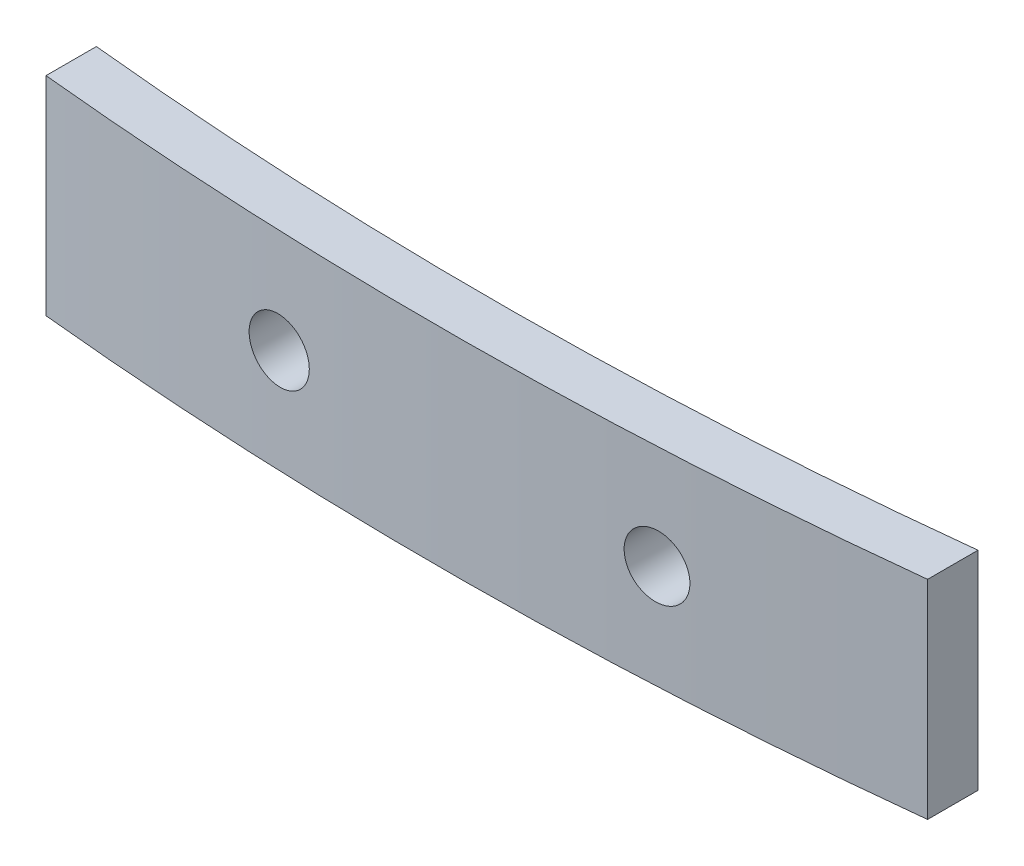
ISO-10303-21;
HEADER;
FILE_DESCRIPTION(('STEP AP214'),'2;1');
FILE_NAME('part.step','',(''),(''),'','','');
FILE_SCHEMA(('AUTOMOTIVE_DESIGN { 1 0 10303 214 1 1 1 1 }'));
ENDSEC;
DATA;
#1=APPLICATION_CONTEXT('core data for automotive mechanical design processes');
#2=APPLICATION_PROTOCOL_DEFINITION('international standard','automotive_design',2000,#1);
#3=PRODUCT_CONTEXT('',#1,'mechanical');
#4=PRODUCT('Part','Part','',(#3));
#5=PRODUCT_RELATED_PRODUCT_CATEGORY('part','',(#4));
#6=PRODUCT_DEFINITION_FORMATION('','',#4);
#7=PRODUCT_DEFINITION_CONTEXT('part definition',#1,'design');
#8=PRODUCT_DEFINITION('design','',#6,#7);
#9=PRODUCT_DEFINITION_SHAPE('','',#8);
#10=(LENGTH_UNIT() NAMED_UNIT(*) SI_UNIT(.MILLI.,.METRE.));
#11=(NAMED_UNIT(*) PLANE_ANGLE_UNIT() SI_UNIT($,.RADIAN.));
#12=(NAMED_UNIT(*) SI_UNIT($,.STERADIAN.) SOLID_ANGLE_UNIT());
#13=UNCERTAINTY_MEASURE_WITH_UNIT(LENGTH_MEASURE(1.E-05),#10,'distance_accuracy_value','');
#14=(GEOMETRIC_REPRESENTATION_CONTEXT(3) GLOBAL_UNCERTAINTY_ASSIGNED_CONTEXT((#13)) GLOBAL_UNIT_ASSIGNED_CONTEXT((#10,
#11,#12)) REPRESENTATION_CONTEXT('',''));
#15=CARTESIAN_POINT('',(0.,0.,0.));
#16=DIRECTION('',(0.,0.,1.));
#17=DIRECTION('',(1.,0.,0.));
#18=AXIS2_PLACEMENT_3D('',#15,#16,#17);
#19=CARTESIAN_POINT('',(-0.864955357142889,8.3,-164.510629845203));
#20=DIRECTION('',(0.,-1.,0.));
#21=DIRECTION('',(0.,0.,-1.));
#22=AXIS2_PLACEMENT_3D('',#19,#20,#21);
#23=CYLINDRICAL_SURFACE('',#22,165.210703971618);
#24=CARTESIAN_POINT('',(8.75,4.15,0.420050564105906));
#25=CARTESIAN_POINT('',(8.7499968756701,4.22012785151778,0.420050786641416));
#26=CARTESIAN_POINT('',(8.74407852912759,4.29030657591266,0.420396098331581));
#27=CARTESIAN_POINT('',(8.72055304510893,4.42872948848566,0.421764998652098));
#28=CARTESIAN_POINT('',(8.70293184075388,4.49697124536185,0.422789403552305));
#29=CARTESIAN_POINT('',(8.65650809093418,4.62949303841441,0.425475899042392));
#30=CARTESIAN_POINT('',(8.62771132313101,4.69377510184941,0.427137660119919));
#31=CARTESIAN_POINT('',(8.55976687690109,4.81657159404113,0.431033993499507));
#32=CARTESIAN_POINT('',(8.52062172919151,4.87508742814449,0.433268425749608));
#33=CARTESIAN_POINT('',(8.43305223614725,4.98477091182553,0.438227928441564));
#34=CARTESIAN_POINT('',(8.38461943762333,5.0359317924697,0.440953445708678));
#35=CARTESIAN_POINT('',(8.27987264209871,5.12940091687988,0.446793671892669));
#36=CARTESIAN_POINT('',(8.22355827497798,5.17170874467183,0.449908399086186));
#37=CARTESIAN_POINT('',(8.10455421106636,5.24633687235545,0.456421883334665));
#38=CARTESIAN_POINT('',(8.04185485362085,5.27864172993917,0.459821069355648));
#39=CARTESIAN_POINT('',(7.91193085692122,5.3322656283006,0.466784376452273));
#40=CARTESIAN_POINT('',(7.84470619336023,5.35358461006432,0.470348498413806));
#41=CARTESIAN_POINT('',(7.70755407236171,5.38465422269091,0.47753187341042));
#42=CARTESIAN_POINT('',(7.63762353654749,5.39439125228122,0.481151186219383));
#43=CARTESIAN_POINT('',(7.49711770071093,5.40197506678777,0.488331935567919));
#44=CARTESIAN_POINT('',(7.42654240018963,5.39982184250167,0.491893372062698));
#45=CARTESIAN_POINT('',(7.28673057784616,5.38368125095752,0.498859654116249));
#46=CARTESIAN_POINT('',(7.2174944251081,5.36969066742186,0.50226445685162));
#47=CARTESIAN_POINT('',(7.0823491009662,5.33026368881494,0.508828518634869));
#48=CARTESIAN_POINT('',(7.01643992557216,5.30482730747152,0.511987777977241));
#49=CARTESIAN_POINT('',(6.8898629668437,5.24324445263167,0.517984389992272));
#50=CARTESIAN_POINT('',(6.82919212444487,5.20710428528416,0.520821930848433));
#51=CARTESIAN_POINT('',(6.71477797427487,5.12513018115386,0.526116471355506));
#52=CARTESIAN_POINT('',(6.66103462822729,5.07929629793533,0.52857347310902));
#53=CARTESIAN_POINT('',(6.56206132205862,4.97928608662616,0.533057060848424));
#54=CARTESIAN_POINT('',(6.51682265931467,4.92511839069348,0.535084087092821));
#55=CARTESIAN_POINT('',(6.43608202244562,4.80994284773568,0.538675511251535));
#56=CARTESIAN_POINT('',(6.40057999610528,4.74893503739491,0.540239911646806));
#57=CARTESIAN_POINT('',(6.340357933409,4.62187706871117,0.542879900415455));
#58=CARTESIAN_POINT('',(6.31562712260273,4.55583202720676,0.543955977304391));
#59=CARTESIAN_POINT('',(6.27760214546197,4.42052190669178,0.545605857793076));
#60=CARTESIAN_POINT('',(6.26430793152615,4.35125684108483,0.546179663483375));
#61=CARTESIAN_POINT('',(6.24954097440456,4.21152203853996,0.546816834887879));
#62=CARTESIAN_POINT('',(6.24806041369155,4.14105312917926,0.546880538155648));
#63=CARTESIAN_POINT('',(6.25694243045685,4.00086716847885,0.546497531082771));
#64=CARTESIAN_POINT('',(6.26730498629387,3.93115011576549,0.546050821674816));
#65=CARTESIAN_POINT('',(6.29957441132196,3.79445965589939,0.544653251256617));
#66=CARTESIAN_POINT('',(6.3214792062226,3.72748575809605,0.543702480832502));
#67=CARTESIAN_POINT('',(6.37620694922726,3.59816781419316,0.541310528570389));
#68=CARTESIAN_POINT('',(6.40902990399195,3.5358237709181,0.539869346433213));
#69=CARTESIAN_POINT('',(6.48467114761501,3.4175119277289,0.536518343609078));
#70=CARTESIAN_POINT('',(6.52749274492063,3.36154624749035,0.534608367792417));
#71=CARTESIAN_POINT('',(6.62190587875572,3.25759845060247,0.530352467316842));
#72=CARTESIAN_POINT('',(6.6734974488955,3.2096163645511,0.528006540987174));
#73=CARTESIAN_POINT('',(6.78402732919472,3.1229563323932,0.522920767674274));
#74=CARTESIAN_POINT('',(6.8429713797798,3.08428572609344,0.520180612638965));
#75=CARTESIAN_POINT('',(6.96649912462997,3.01738774672038,0.51436476411554));
#76=CARTESIAN_POINT('',(7.03108284432829,2.98916042074618,0.511289069114225));
#77=CARTESIAN_POINT('',(7.16412839034453,2.94391857326429,0.504869298035268));
#78=CARTESIAN_POINT('',(7.23259422327701,2.92691587381022,0.501524943142095));
#79=CARTESIAN_POINT('',(7.37140001377697,2.90464748821122,0.494654869625039));
#80=CARTESIAN_POINT('',(7.44173998602875,2.89938189405638,0.491129149579919));
#81=CARTESIAN_POINT('',(7.58236818374903,2.90073434853974,0.483989440786617));
#82=CARTESIAN_POINT('',(7.65265629683359,2.90736367487349,0.480375371478415));
#83=CARTESIAN_POINT('',(7.79112055707237,2.9323391674771,0.473168949725147));
#84=CARTESIAN_POINT('',(7.85929669259729,2.95068539825232,0.469576597399751));
#85=CARTESIAN_POINT('',(7.99162839490877,2.99858567305698,0.462525628244137));
#86=CARTESIAN_POINT('',(8.05578240324823,3.02814403053687,0.459067063448728));
#87=CARTESIAN_POINT('',(8.17821506459887,3.09763191261792,0.452400980172807));
#88=CARTESIAN_POINT('',(8.23649395687128,3.13756101463856,0.449193451470163));
#89=CARTESIAN_POINT('',(8.34548259383017,3.22663160990741,0.44314404983962));
#90=CARTESIAN_POINT('',(8.39619733991694,3.27576696706239,0.440301935473492));
#91=CARTESIAN_POINT('',(8.4886680570718,3.38189249727254,0.435084215694027));
#92=CARTESIAN_POINT('',(8.5304218580004,3.43888456757103,0.432708723297817));
#93=CARTESIAN_POINT('',(8.60372478212185,3.55903320833602,0.428516976642923));
#94=CARTESIAN_POINT('',(8.6352829269122,3.62218426425832,0.426700228050152));
#95=CARTESIAN_POINT('',(8.68731128395109,3.75285295151056,0.423695249568868));
#96=CARTESIAN_POINT('',(8.70779492398493,3.82036518318595,0.422506258568424));
#97=CARTESIAN_POINT('',(8.73161237551989,3.93192617529781,0.421121713201919));
#98=CARTESIAN_POINT('',(8.73849904429465,3.97524605096882,0.420720697745676));
#99=CARTESIAN_POINT('',(8.74769383053028,4.06237066227353,0.420185053794028));
#100=CARTESIAN_POINT('',(8.75000195246986,4.1061753974329,0.420050425038045));
#101=CARTESIAN_POINT('',(8.75,4.15,0.420050564105906));
#102=B_SPLINE_CURVE_WITH_KNOTS('',3,(#24,#25,#26,#27,#28,#29,#30,#31,#32,#33,#34,#35,#36,#37,
#38,#39,#40,#41,#42,#43,#44,#45,#46,#47,#48,#49,#50,#51,#52,#53,#54,#55,#56,#57,#58,#59,#60,#61,
#62,#63,#64,#65,#66,#67,#68,#69,#70,#71,#72,#73,#74,#75,#76,#77,#78,#79,#80,#81,#82,#83,#84,#85,
#86,#87,#88,#89,#90,#91,#92,#93,#94,#95,#96,#97,#98,#99,#100,#101),.UNSPECIFIED.,.T.,.F.,(4,2,2,
2,2,2,2,2,2,2,2,2,2,2,2,2,2,2,2,2,2,2,2,2,2,2,2,2,2,2,2,2,2,2,2,2,2,2,4),(0.,0.210223445977021,
0.420700039769353,0.631067963784939,0.841384489415681,1.0518933518043,1.26241210304977,
1.47325424539596,1.68409752033319,1.89518815550945,2.10627895405728,2.31742712559702,
2.52857504389096,2.73959881074264,2.95062141157759,3.16142688888051,3.37223123566221,
3.58282422776111,3.79341634332708,4.00386909080652,4.21432145372016,4.42473600850072,
4.63515069164558,4.84563509774261,5.05612031052455,5.26677089982141,5.47742243913898,
5.68829548939093,5.89917019236428,6.11024493345311,6.32132083658665,6.53247802584897,
6.74362661236154,6.95463496292118,7.16569435743921,7.37656648187793,7.58718234815398,
7.71855622861525,7.84992998056732),.UNSPECIFIED.);
#103=CARTESIAN_POINT('',(8.75,4.15,0.420050564105906));
#104=VERTEX_POINT('',#103);
#105=EDGE_CURVE('E122',#104,#104,#102,.T.);
#106=ORIENTED_EDGE('',*,*,#105,.T.);
#107=EDGE_LOOP('',(#106));
#108=FACE_BOUND('',#107,.T.);
#109=CARTESIAN_POINT('',(-6.25,4.15,0.612288009926604));
#110=CARTESIAN_POINT('',(-6.25000311571131,4.22018355239191,0.612287948701828));
#111=CARTESIAN_POINT('',(-6.25593075978931,4.2904179787371,0.612094924403045));
#112=CARTESIAN_POINT('',(-6.27949447756528,4.42895209563306,0.611323893589454));
#113=CARTESIAN_POINT('',(-6.2971446367521,4.49724935546489,0.610745423930159));
#114=CARTESIAN_POINT('',(-6.34364908837448,4.62988168369549,0.609208938538244));
#115=CARTESIAN_POINT('',(-6.37249792853421,4.69421866259394,0.60825110749982));
#116=CARTESIAN_POINT('',(-6.44057119968027,4.81711670051832,0.605966440329405));
#117=CARTESIAN_POINT('',(-6.47979305791574,4.87567918681573,0.60463969569242));
#118=CARTESIAN_POINT('',(-6.56751337852462,4.9854062839793,0.601633356485878));
#119=CARTESIAN_POINT('',(-6.61601467183209,5.03656862885316,0.599953654221964));
#120=CARTESIAN_POINT('',(-6.72090916987377,5.13002658482638,0.596266618886532));
#121=CARTESIAN_POINT('',(-6.77730270118661,5.17232182882653,0.594259272256609));
#122=CARTESIAN_POINT('',(-6.89640796884524,5.24686589631549,0.589951115896844));
#123=CARTESIAN_POINT('',(-6.95912282670767,5.27910972386023,0.587650161030504));
#124=CARTESIAN_POINT('',(-7.08906630444559,5.3326117277739,0.582802406813894));
#125=CARTESIAN_POINT('',(-7.15629493167516,5.35386988624392,0.580255607063078));
#126=CARTESIAN_POINT('',(-7.29340442194187,5.38481197096959,0.574973575011229));
#127=CARTESIAN_POINT('',(-7.36328700154222,5.39448826991545,0.572238219788182));
#128=CARTESIAN_POINT('',(-7.50368007668842,5.4019696691906,0.56665198267269));
#129=CARTESIAN_POINT('',(-7.57419057342636,5.39977474697769,0.563801100560882));
#130=CARTESIAN_POINT('',(-7.71387945362295,5.38357292521863,0.558064449045412));
#131=CARTESIAN_POINT('',(-7.78305707886924,5.36955949439595,0.555178661221106));
#132=CARTESIAN_POINT('',(-7.91807733611011,5.33010934361725,0.549464502868027));
#133=CARTESIAN_POINT('',(-7.98391995872912,5.30467259154922,0.546636132500682));
#134=CARTESIAN_POINT('',(-8.11040870949573,5.24309180134629,0.54113211185841));
#135=CARTESIAN_POINT('',(-8.17105421102282,5.20694647440621,0.538456480012221));
#136=CARTESIAN_POINT('',(-8.28541568787778,5.12497267595302,0.533354465386389));
#137=CARTESIAN_POINT('',(-8.33913167949136,5.07914422719782,0.530928082020964));
#138=CARTESIAN_POINT('',(-8.43807894852099,4.97912832988149,0.526417399872258));
#139=CARTESIAN_POINT('',(-8.48331455816759,4.92494517527411,0.524332926491592));
#140=CARTESIAN_POINT('',(-8.56404495416109,4.80973912005988,0.520586488920757));
#141=CARTESIAN_POINT('',(-8.59953979122227,4.74871625506557,0.518924522530854));
#142=CARTESIAN_POINT('',(-8.65974439972634,4.6216271240783,0.516091877374447));
#143=CARTESIAN_POINT('',(-8.68446475412751,4.55556588220122,0.514920716570525));
#144=CARTESIAN_POINT('',(-8.72246441910089,4.42022399273247,0.513115788962741));
#145=CARTESIAN_POINT('',(-8.73574379707123,4.35094336410855,0.512482018993142));
#146=CARTESIAN_POINT('',(-8.75047458862379,4.2111980915843,0.511778780959092));
#147=CARTESIAN_POINT('',(-8.75193694008761,4.14073460310762,0.511708791058003));
#148=CARTESIAN_POINT('',(-8.74302066539331,4.0005626973153,0.512134684324352));
#149=CARTESIAN_POINT('',(-8.73264207065434,3.93085427799663,0.512630565990288));
#150=CARTESIAN_POINT('',(-8.70034544962065,3.79419204857333,0.514167162544728));
#151=CARTESIAN_POINT('',(-8.67843080347073,3.7272374377756,0.515207717839497));
#152=CARTESIAN_POINT('',(-8.62368951853576,3.59795898046812,0.517790426931301));
#153=CARTESIAN_POINT('',(-8.5908628581906,3.5356351431082,0.519332581719403));
#154=CARTESIAN_POINT('',(-8.51521227384373,3.41735055124752,0.522856772119375));
#155=CARTESIAN_POINT('',(-8.47238306461757,3.36139318403883,0.524839040254345));
#156=CARTESIAN_POINT('',(-8.3779548356778,3.25746147580423,0.52916466983499));
#157=CARTESIAN_POINT('',(-8.32635576524137,3.20948718095373,0.53150803336915));
#158=CARTESIAN_POINT('',(-8.21579579794787,3.12283180802716,0.536469223168007));
#159=CARTESIAN_POINT('',(-8.15682751540769,3.08416016875794,0.539087324356433));
#160=CARTESIAN_POINT('',(-8.03324331961947,3.01726497292627,0.544500869169606));
#161=CARTESIAN_POINT('',(-7.96862738257522,2.98904146038931,0.547296313541571));
#162=CARTESIAN_POINT('',(-7.8355196571947,2.94381943465548,0.552971163005119));
#163=CARTESIAN_POINT('',(-7.76702449530367,2.92683085980956,0.555850640087178));
#164=CARTESIAN_POINT('',(-7.62815314481567,2.90459979079998,0.561598861621527));
#165=CARTESIAN_POINT('',(-7.55777694822369,2.89935734656927,0.564467606028139));
#166=CARTESIAN_POINT('',(-7.41711753048462,2.90076871395252,0.570110501825143));
#167=CARTESIAN_POINT('',(-7.34683434598474,2.90742630602083,0.572884622869854));
#168=CARTESIAN_POINT('',(-7.20837958754747,2.93245878709451,0.578262808404097));
#169=CARTESIAN_POINT('',(-7.14020801585102,2.95083368853438,0.580866872713159));
#170=CARTESIAN_POINT('',(-7.00793228027882,2.99877590873363,0.58584172349279));
#171=CARTESIAN_POINT('',(-6.94382705094201,3.02834028137105,0.588212571161087));
#172=CARTESIAN_POINT('',(-6.82149085700398,3.09782436801472,0.592671585008922));
#173=CARTESIAN_POINT('',(-6.76325964443876,3.13774364464784,0.59475976312226));
#174=CARTESIAN_POINT('',(-6.65436671082572,3.22677356012875,0.598613974910899));
#175=CARTESIAN_POINT('',(-6.60369956033725,3.27587754864781,0.600380239856701));
#176=CARTESIAN_POINT('',(-6.51131557625305,3.38191903380727,0.603565383454531));
#177=CARTESIAN_POINT('',(-6.46960094041181,3.43885844835036,0.604984176817734));
#178=CARTESIAN_POINT('',(-6.39633408535729,3.55892548464134,0.607454882195929));
#179=CARTESIAN_POINT('',(-6.36478028832285,3.62205214361811,0.60850685117518));
#180=CARTESIAN_POINT('',(-6.31275419768299,3.75266197816612,0.610231582461445));
#181=CARTESIAN_POINT('',(-6.29226858560104,3.82013980793337,0.610904800564298));
#182=CARTESIAN_POINT('',(-6.26842481149668,3.93170707646447,0.611686340087224));
#183=CARTESIAN_POINT('',(-6.26152415895528,3.9750705609376,0.61191184300066));
#184=CARTESIAN_POINT('',(-6.25231078003501,4.06228273831287,0.612212697036008));
#185=CARTESIAN_POINT('',(-6.24999805250957,4.10613143109375,0.612288048195446));
#186=CARTESIAN_POINT('',(-6.25,4.15,0.612288009926604));
#187=B_SPLINE_CURVE_WITH_KNOTS('',3,(#109,#110,#111,#112,#113,#114,#115,#116,#117,#118,#119,
#120,#121,#122,#123,#124,#125,#126,#127,#128,#129,#130,#131,#132,#133,#134,#135,#136,#137,#138,
#139,#140,#141,#142,#143,#144,#145,#146,#147,#148,#149,#150,#151,#152,#153,#154,#155,#156,#157,
#158,#159,#160,#161,#162,#163,#164,#165,#166,#167,#168,#169,#170,#171,#172,#173,#174,#175,#176,
#177,#178,#179,#180,#181,#182,#183,#184,#185,#186),.UNSPECIFIED.,.T.,.F.,(4,2,2,2,2,2,2,2,2,2,2,
2,2,2,2,2,2,2,2,2,2,2,2,2,2,2,2,2,2,2,2,2,2,2,2,2,2,2,4),(0.,0.210390503068588,
0.421034264711717,0.631575599082519,0.842064763174761,1.05261824517612,1.26318044240039,
1.47384713095046,1.68451416273795,1.89531985448584,2.10612594653145,2.3170486129942,
2.52797187238342,2.7389205272615,2.94986868635966,3.16070878649296,3.3715477888891,
3.58217923083019,3.79280943194546,4.00324465064315,4.21367931096638,4.42405234673518,
4.63442579816419,4.84491066085422,5.05539674098095,5.26609549541984,5.47679513767428,
5.6876809150019,5.89856758880574,6.10952126989617,6.32047517485255,6.53137357548215,
6.74226306958042,6.95300045295797,7.1637895112675,7.37454582149352,7.58504795814686,
7.71655359263121,7.8480591942506),.UNSPECIFIED.);
#188=CARTESIAN_POINT('',(-6.25,4.15,0.612288009926604));
#189=VERTEX_POINT('',#188);
#190=EDGE_CURVE('E139',#189,#189,#187,.T.);
#191=ORIENTED_EDGE('',*,*,#190,.T.);
#192=EDGE_LOOP('',(#191));
#193=FACE_BOUND('',#192,.T.);
#194=CARTESIAN_POINT('',(-0.864955357142889,0.,-164.510629845203));
#195=DIRECTION('',(0.,-1.,0.));
#196=DIRECTION('',(0.,0.,1.));
#197=AXIS2_PLACEMENT_3D('',#194,#195,#196);
#198=CIRCLE('',#197,165.210703971618);
#199=CARTESIAN_POINT('',(17.5,0.,-0.323830371166123));
#200=VERTEX_POINT('',#199);
#201=CARTESIAN_POINT('',(-17.5,0.,-0.139549674366385));
#202=VERTEX_POINT('',#201);
#203=EDGE_CURVE('E118',#200,#202,#198,.T.);
#204=ORIENTED_EDGE('',*,*,#203,.T.);
#205=DIRECTION('',(0.,-1.,0.));
#206=VECTOR('',#205,1.);
#207=CARTESIAN_POINT('',(-17.5,8.3,-0.139549674366385));
#208=LINE('',#207,#206);
#209=CARTESIAN_POINT('',(-17.5,8.3,-0.139549674366385));
#210=VERTEX_POINT('',#209);
#211=EDGE_CURVE('E11',#210,#202,#208,.T.);
#212=ORIENTED_EDGE('',*,*,#211,.F.);
#213=CARTESIAN_POINT('',(-0.864955357142889,8.3,-164.510629845203));
#214=DIRECTION('',(0.,-1.,0.));
#215=DIRECTION('',(0.,0.,1.));
#216=AXIS2_PLACEMENT_3D('',#213,#214,#215);
#217=CIRCLE('',#216,165.210703971618);
#218=CARTESIAN_POINT('',(17.5,8.3,-0.323830371166123));
#219=VERTEX_POINT('',#218);
#220=EDGE_CURVE('E101',#219,#210,#217,.T.);
#221=ORIENTED_EDGE('',*,*,#220,.F.);
#222=DIRECTION('',(0.,-1.,0.));
#223=VECTOR('',#222,1.);
#224=CARTESIAN_POINT('',(17.5,8.3,-0.323830371166123));
#225=LINE('',#224,#223);
#226=EDGE_CURVE('E114',#219,#200,#225,.T.);
#227=ORIENTED_EDGE('',*,*,#226,.T.);
#228=EDGE_LOOP('',(#204,#212,#221,#227));
#229=FACE_BOUND('',#228,.T.);
#230=ADVANCED_FACE('F41',(#108,#193,#229),#23,.F.);
#231=CARTESIAN_POINT('',(-17.5,8.3,-0.139549674366385));
#232=DIRECTION('',(1.,0.,0.));
#233=DIRECTION('',(0.,0.,-1.));
#234=AXIS2_PLACEMENT_3D('',#231,#232,#233);
#235=PLANE('',#234);
#236=DIRECTION('',(0.,0.,1.));
#237=VECTOR('',#236,1.);
#238=CARTESIAN_POINT('',(-17.5,0.,-0.139549674366385));
#239=LINE('',#238,#237);
#240=CARTESIAN_POINT('',(-17.5,0.,1.87054340590159));
#241=VERTEX_POINT('',#240);
#242=EDGE_CURVE('E106',#202,#241,#239,.T.);
#243=ORIENTED_EDGE('',*,*,#242,.T.);
#244=DIRECTION('',(0.,-1.,0.));
#245=VECTOR('',#244,1.);
#246=CARTESIAN_POINT('',(-17.5,8.3,1.87054340590159));
#247=LINE('',#246,#245);
#248=CARTESIAN_POINT('',(-17.5,8.3,1.87054340590159));
#249=VERTEX_POINT('',#248);
#250=EDGE_CURVE('E57',#249,#241,#247,.T.);
#251=ORIENTED_EDGE('',*,*,#250,.F.);
#252=DIRECTION('',(0.,0.,1.));
#253=VECTOR('',#252,1.);
#254=CARTESIAN_POINT('',(-17.5,8.3,-0.139549674366385));
#255=LINE('',#254,#253);
#256=EDGE_CURVE('E96',#210,#249,#255,.T.);
#257=ORIENTED_EDGE('',*,*,#256,.F.);
#258=ORIENTED_EDGE('',*,*,#211,.T.);
#259=EDGE_LOOP('',(#243,#251,#257,#258));
#260=FACE_BOUND('',#259,.T.);
#261=ADVANCED_FACE('F105',(#260),#235,.F.);
#262=CARTESIAN_POINT('',(-0.864955357142889,8.3,-164.510629845203));
#263=DIRECTION('',(0.,-1.,0.));
#264=DIRECTION('',(0.,0.,-1.));
#265=AXIS2_PLACEMENT_3D('',#262,#263,#264);
#266=CYLINDRICAL_SURFACE('',#265,167.210703971618);
#267=CARTESIAN_POINT('',(8.75,4.15,2.42340549859404));
#268=CARTESIAN_POINT('',(8.7499968759262,4.07987012137044,2.42340571844586));
#269=CARTESIAN_POINT('',(8.74407819084325,4.00968936898739,2.42374690560115));
#270=CARTESIAN_POINT('',(8.72055131717487,3.87126241398294,2.42509945786627));
#271=CARTESIAN_POINT('',(8.70292906080826,3.80301864269076,2.42611162950184));
#272=CARTESIAN_POINT('',(8.65650238633006,3.67049285173357,2.4287660522962));
#273=CARTESIAN_POINT('',(8.62770373590653,3.60620880840686,2.43040797845888));
#274=CARTESIAN_POINT('',(8.55975462355993,3.48340863823658,2.43425781776976));
#275=CARTESIAN_POINT('',(8.52060669359667,3.42489110541184,2.43646559247862));
#276=CARTESIAN_POINT('',(8.43303156162517,3.31520582991078,2.44136589382248));
#277=CARTESIAN_POINT('',(8.38459608361104,3.26404471412625,2.44405885266811));
#278=CARTESIAN_POINT('',(8.27984339346623,3.17057563894572,2.44982931904001));
#279=CARTESIAN_POINT('',(8.22352581262794,3.12826809393164,2.45290684455476));
#280=CARTESIAN_POINT('',(8.10451714174231,3.05364269118637,2.45934241559074));
#281=CARTESIAN_POINT('',(8.041816623435,3.02133990455394,2.46270087473628));
#282=CARTESIAN_POINT('',(7.91189047346441,2.96772029239522,2.46958074239435));
#283=CARTESIAN_POINT('',(7.84466481828969,2.9464035239544,2.4731021517535));
#284=CARTESIAN_POINT('',(7.70751294966958,2.91533895910661,2.48019932744157));
#285=CARTESIAN_POINT('',(7.63758373153518,2.90560444024127,2.48377515140502));
#286=CARTESIAN_POINT('',(7.49708099898386,2.89802511241837,2.49086960284267));
#287=CARTESIAN_POINT('',(7.42650748410816,2.90018031192793,2.49438823027613));
#288=CARTESIAN_POINT('',(7.28670012554887,2.91632414244071,2.50127073842057));
#289=CARTESIAN_POINT('',(7.21746664220022,2.93031591229712,2.50463457783493));
#290=CARTESIAN_POINT('',(7.08232692497333,2.96974430691074,2.51111965594278));
#291=CARTESIAN_POINT('',(7.01642068728273,2.99518091855414,2.51424089491422));
#292=CARTESIAN_POINT('',(6.88984875734409,3.05676359416933,2.520165375863));
#293=CARTESIAN_POINT('',(6.82918007858731,3.09290350222251,2.52296879935137));
#294=CARTESIAN_POINT('',(6.71477020629758,3.17487622745391,2.52819967652553));
#295=CARTESIAN_POINT('',(6.66102897533549,3.22070899225789,2.53062713224269));
#296=CARTESIAN_POINT('',(6.56205835230829,3.32071733576925,2.53505686160251));
#297=CARTESIAN_POINT('',(6.51682046506705,3.37488448861664,2.5370595598542));
#298=CARTESIAN_POINT('',(6.43608126204884,3.49005848772344,2.54060787994089));
#299=CARTESIAN_POINT('',(6.40057989533456,3.55106529819833,2.54215350416711));
#300=CARTESIAN_POINT('',(6.34035812216982,3.67812241017294,2.54476184415459));
#301=CARTESIAN_POINT('',(6.31562719806153,3.7441677170099,2.545825031073));
#302=CARTESIAN_POINT('',(6.2776020971927,3.87947825233901,2.54745514622849));
#303=CARTESIAN_POINT('',(6.26430787395331,3.94874346774423,2.54802207648237));
#304=CARTESIAN_POINT('',(6.24954082405741,4.08847961995922,2.54865161672816));
#305=CARTESIAN_POINT('',(6.24806036595877,4.15894974892714,2.54871455229005));
#306=CARTESIAN_POINT('',(6.25694299560165,4.29913811959953,2.54833610858745));
#307=CARTESIAN_POINT('',(6.2673060622287,4.36885636264422,2.54789473022203));
#308=CARTESIAN_POINT('',(6.29957701281969,4.50554944308895,2.54651384125092));
#309=CARTESIAN_POINT('',(6.321482871838,4.57252475945876,2.54557441801678));
#310=CARTESIAN_POINT('',(6.3762133200028,4.70184538321581,2.54321101100255));
#311=CARTESIAN_POINT('',(6.40903791561766,4.76419068786017,2.54178702693539));
#312=CARTESIAN_POINT('',(6.48468275935071,4.88250430561796,2.53847602046889));
#313=CARTESIAN_POINT('',(6.52750623741589,4.9384705493861,2.53658884843546));
#314=CARTESIAN_POINT('',(6.6219236312372,5.04241915222049,2.5323837556043));
#315=CARTESIAN_POINT('',(6.67351757989245,5.09040148133676,2.53006583319077));
#316=CARTESIAN_POINT('',(6.78405166747195,5.17706068505861,2.5250408107236));
#317=CARTESIAN_POINT('',(6.84299741070677,5.21573039397913,2.52233341352717));
#318=CARTESIAN_POINT('',(6.96652874466183,5.28262627072503,2.51658709195815));
#319=CARTESIAN_POINT('',(7.03111436007255,5.31085239282717,2.51354816613418));
#320=CARTESIAN_POINT('',(7.16416214246729,5.35609080416202,2.5072052239132));
#321=CARTESIAN_POINT('',(7.23262822078288,5.37309155233608,2.50390093859557));
#322=CARTESIAN_POINT('',(7.37143437970746,5.39535605206446,2.49711318891029));
#323=CARTESIAN_POINT('',(7.44177447473131,5.40061971331127,2.4936297231642));
#324=CARTESIAN_POINT('',(7.58240109739181,5.39926339313341,2.4865756781979));
#325=CARTESIAN_POINT('',(7.65268751511746,5.39263240341705,2.48300502130082));
#326=CARTESIAN_POINT('',(7.79114816585301,5.36765414255638,2.4758851856896));
#327=CARTESIAN_POINT('',(7.8593223874094,5.34930680789114,2.47233600709201));
#328=CARTESIAN_POINT('',(7.99164948058038,5.30140518650286,2.46536983325012));
#329=CARTESIAN_POINT('',(8.05580082929915,5.27184668517906,2.46195288824925));
#330=CARTESIAN_POINT('',(8.17822818102457,5.20235946919012,2.45536704386846));
#331=CARTESIAN_POINT('',(8.23650442308893,5.16243117670771,2.45219813439716));
#332=CARTESIAN_POINT('',(8.34548871241756,5.07336264520676,2.44622154154587));
#333=CARTESIAN_POINT('',(8.39620166121003,5.02422841925977,2.44341362438257));
#334=CARTESIAN_POINT('',(8.48866906289056,4.91810600261773,2.43825869201559));
#335=CARTESIAN_POINT('',(8.53042134428022,4.86111591364173,2.43591178854408));
#336=CARTESIAN_POINT('',(8.60372300458297,4.74097006582692,2.43177041236711));
#337=CARTESIAN_POINT('',(8.63528107441361,4.67781961903462,2.42997546915954));
#338=CARTESIAN_POINT('',(8.68730942116913,4.5471524942547,2.42700655200384));
#339=CARTESIAN_POINT('',(8.70779312246654,4.47964121417121,2.42583182626751));
#340=CARTESIAN_POINT('',(8.73161132337617,4.36808002854529,2.42446385353792));
#341=CARTESIAN_POINT('',(8.7384983882257,4.32475891370707,2.42406762781939));
#342=CARTESIAN_POINT('',(8.74769370050571,4.23763182151305,2.42353838177779));
#343=CARTESIAN_POINT('',(8.75000195230871,4.1938258446203,2.42340536120337));
#344=CARTESIAN_POINT('',(8.75,4.15,2.42340549859404));
#345=B_SPLINE_CURVE_WITH_KNOTS('',3,(#267,#268,#269,#270,#271,#272,#273,#274,#275,#276,#277,
#278,#279,#280,#281,#282,#283,#284,#285,#286,#287,#288,#289,#290,#291,#292,#293,#294,#295,#296,
#297,#298,#299,#300,#301,#302,#303,#304,#305,#306,#307,#308,#309,#310,#311,#312,#313,#314,#315,
#316,#317,#318,#319,#320,#321,#322,#323,#324,#325,#326,#327,#328,#329,#330,#331,#332,#333,#334,
#335,#336,#337,#338,#339,#340,#341,#342,#343,#344),.UNSPECIFIED.,.T.,.F.,(4,2,2,2,2,2,2,2,2,2,2,
2,2,2,2,2,2,2,2,2,2,2,2,2,2,2,2,2,2,2,2,2,2,2,2,2,2,2,4),(0.,0.210229526330766,
0.420712208603477,0.631086413349325,0.841409197426138,1.05192027556956,1.26244120425612,
1.47327773487148,1.684115361023,1.89519445291078,2.10627369511606,2.31740892942866,
2.52854392181756,2.7395577165822,2.95057037118733,3.16137108216245,3.37217069029722,
3.58276398222082,3.79335641828739,4.00381280507794,4.21426881667042,4.42468792036777,
4.63510714871938,4.84559444323099,5.0560825273238,5.26673205968139,5.47738251427596,
5.68824920749127,5.89911752315157,6.11018109445236,6.32124581005774,6.53238994974381,
6.74352549451836,6.95452360890834,7.16557279828773,7.37644158314923,7.58705417601551,
7.71843177902917,7.84980925658394),.UNSPECIFIED.);
#346=CARTESIAN_POINT('',(8.75,4.15,2.42340549859404));
#347=VERTEX_POINT('',#346);
#348=EDGE_CURVE('E45',#347,#347,#345,.T.);
#349=ORIENTED_EDGE('',*,*,#348,.T.);
#350=EDGE_LOOP('',(#349));
#351=FACE_BOUND('',#350,.T.);
#352=CARTESIAN_POINT('',(-6.25,4.15,2.61333856411394));
#353=CARTESIAN_POINT('',(-6.25000311565992,4.07981574606103,2.61333850362469));
#354=CARTESIAN_POINT('',(-6.25593087719105,4.00958061729741,2.61314778671223));
#355=CARTESIAN_POINT('',(-6.27949507550797,3.87104510438208,2.61238597227617));
#356=CARTESIAN_POINT('',(-6.297145598251,3.80274715099205,2.61181441713833));
#357=CARTESIAN_POINT('',(-6.34365105592586,3.67011345543528,2.61029629603647));
#358=CARTESIAN_POINT('',(-6.37250054084197,3.60577580359118,2.60934991247952));
#359=CARTESIAN_POINT('',(-6.44057541610514,3.48287650486345,2.60709254775912));
#360=CARTESIAN_POINT('',(-6.4797982334516,3.42431343059236,2.60578165700387));
#361=CARTESIAN_POINT('',(-6.56752060650743,3.31458558372347,2.60281124515757));
#362=CARTESIAN_POINT('',(-6.61602294900017,3.26342304174475,2.60115161932128));
#363=CARTESIAN_POINT('',(-6.72091982579359,3.169964875977,2.5975086494016));
#364=CARTESIAN_POINT('',(-6.77731468628578,3.12766961884637,2.59552529193808));
#365=CARTESIAN_POINT('',(-6.89642214749191,3.05312628172291,2.59126864347545));
#366=CARTESIAN_POINT('',(-6.95913779281653,3.02088307452851,2.58899521261149));
#367=CARTESIAN_POINT('',(-7.08908295006164,2.96738245851538,2.58420544720455));
#368=CARTESIAN_POINT('',(-7.15631246894652,2.94612506664691,2.58168911228679));
#369=CARTESIAN_POINT('',(-7.2934227128282,2.91518499163511,2.5764703066392));
#370=CARTESIAN_POINT('',(-7.36330511368689,2.90550975498857,2.57376771734056));
#371=CARTESIAN_POINT('',(-7.50369776502639,2.89803039840271,2.56824840244642));
#372=CARTESIAN_POINT('',(-7.57420801664396,2.90022629996097,2.56543167664425));
#373=CARTESIAN_POINT('',(-7.71389536100917,2.91642989677656,2.55976380259775));
#374=CARTESIAN_POINT('',(-7.78307171352842,2.93044396776616,2.55691263659198));
#375=CARTESIAN_POINT('',(-7.91808934889109,2.96989498022109,2.55126704410276));
#376=CARTESIAN_POINT('',(-7.98393062249905,2.99533195331666,2.54847261777646));
#377=CARTESIAN_POINT('',(-8.11041645198137,3.05691261500473,2.54303467145691));
#378=CARTESIAN_POINT('',(-8.17106039634818,3.09305756125267,2.54039116923328));
#379=CARTESIAN_POINT('',(-8.28541885549217,3.175029992563,2.53535042867961));
#380=CARTESIAN_POINT('',(-8.33913338623508,3.22085745531573,2.53295318978217));
#381=CARTESIAN_POINT('',(-8.43807859434589,3.32087135476026,2.5284966624215));
#382=CARTESIAN_POINT('',(-8.48331350090785,3.37505359981428,2.52643720555466));
#383=CARTESIAN_POINT('',(-8.56404270602494,3.49025738791354,2.52273572913799));
#384=CARTESIAN_POINT('',(-8.59953705405136,3.55127889622065,2.52109370746804));
#385=CARTESIAN_POINT('',(-8.65974178650218,3.67836643118199,2.51829501245051));
#386=CARTESIAN_POINT('',(-8.68446250170708,3.74442755361697,2.51713787419193));
#387=CARTESIAN_POINT('',(-8.72246289000835,3.87976910315633,2.51535454955887));
#388=CARTESIAN_POINT('',(-8.73574262890663,3.94904951174283,2.51472836013067));
#389=CARTESIAN_POINT('',(-8.7504743705803,4.08879588610972,2.51403350758343));
#390=CARTESIAN_POINT('',(-8.75193705084305,4.15926072396618,2.51396434115775));
#391=CARTESIAN_POINT('',(-8.74302097445947,4.29943537547764,2.51438511956936));
#392=CARTESIAN_POINT('',(-8.73264224847514,4.36914519108721,2.51487506295889));
#393=CARTESIAN_POINT('',(-8.70034474469929,4.50581071281282,2.51639328094994));
#394=CARTESIAN_POINT('',(-8.67842926680251,4.57276720057096,2.51742140161439));
#395=CARTESIAN_POINT('',(-8.62368559505439,4.70204927590946,2.51997326186475));
#396=CARTESIAN_POINT('',(-8.59085738018815,4.76437485457169,2.52149700240508));
#397=CARTESIAN_POINT('',(-8.51520341465857,4.88266186717285,2.52497910253712));
#398=CARTESIAN_POINT('',(-8.47237250426532,4.93861999433292,2.52693768640997));
#399=CARTESIAN_POINT('',(-8.37794037154417,5.04255288839341,2.53121164028211));
#400=CARTESIAN_POINT('',(-8.32633909960902,5.09052761013476,2.53352701229948));
#401=CARTESIAN_POINT('',(-8.21577563837456,5.17718226167879,2.53842888642847));
#402=CARTESIAN_POINT('',(-8.15680623875195,5.21585297678,2.54101565371978));
#403=CARTESIAN_POINT('',(-8.03321979513085,5.28274613144361,2.54636440600295));
#404=CARTESIAN_POINT('',(-7.96860272804309,5.31096852828781,2.54912639171115));
#405=CARTESIAN_POINT('',(-7.83549424666815,5.3561875837718,2.55473325469572));
#406=CARTESIAN_POINT('',(-7.76699953930919,5.37317454066665,2.55757820140137));
#407=CARTESIAN_POINT('',(-7.62812938553602,5.39540260675064,2.56325748378831));
#408=CARTESIAN_POINT('',(-7.55775393123791,5.40064366669441,2.56609181942506));
#409=CARTESIAN_POINT('',(-7.41709683864988,5.39922983344184,2.57166700330105));
#410=CARTESIAN_POINT('',(-7.34681523622105,5.39257125069326,2.57440782227638));
#411=CARTESIAN_POINT('',(-7.20836386994777,5.36753735918785,2.57972143960436));
#412=CARTESIAN_POINT('',(-7.14019410839206,5.34916203773327,2.58229423777492));
#413=CARTESIAN_POINT('',(-7.00792165421107,5.30121947308366,2.58720937043567));
#414=CARTESIAN_POINT('',(-6.94381792318053,5.27165510095635,2.58955176385274));
#415=CARTESIAN_POINT('',(-6.8214847420781,5.20217159213611,2.59395725996007));
#416=CARTESIAN_POINT('',(-6.76325504445718,5.16225289205843,2.59602037442122));
#417=CARTESIAN_POINT('',(-6.65436417618515,5.07322407013564,2.59982835513281));
#418=CARTESIAN_POINT('',(-6.60369768662673,5.02412046295314,2.60157344522986));
#419=CARTESIAN_POINT('',(-6.511314947515,4.91808008217984,2.60472040388598));
#420=CARTESIAN_POINT('',(-6.46960089641142,4.86114139014878,2.60612218815137));
#421=CARTESIAN_POINT('',(-6.39633444475318,4.74107519374575,2.60856329527341));
#422=CARTESIAN_POINT('',(-6.36478061938567,4.67794855875706,2.60960266895417));
#423=CARTESIAN_POINT('',(-6.31275448682694,4.54733887617282,2.61130675000581));
#424=CARTESIAN_POINT('',(-6.29226886194857,4.47986117392516,2.61197190768784));
#425=CARTESIAN_POINT('',(-6.26842497106538,4.36829386498496,2.61274409320369));
#426=CARTESIAN_POINT('',(-6.26152425807603,4.32493018861701,2.61296689801315));
#427=CARTESIAN_POINT('',(-6.25231079937943,4.23771763349944,2.61326415235462));
#428=CARTESIAN_POINT('',(-6.24999805255291,4.1938687548682,2.61333860192282));
#429=CARTESIAN_POINT('',(-6.25,4.15,2.61333856411394));
#430=B_SPLINE_CURVE_WITH_KNOTS('',3,(#352,#353,#354,#355,#356,#357,#358,#359,#360,#361,#362,
#363,#364,#365,#366,#367,#368,#369,#370,#371,#372,#373,#374,#375,#376,#377,#378,#379,#380,#381,
#382,#383,#384,#385,#386,#387,#388,#389,#390,#391,#392,#393,#394,#395,#396,#397,#398,#399,#400,
#401,#402,#403,#404,#405,#406,#407,#408,#409,#410,#411,#412,#413,#414,#415,#416,#417,#418,#419,
#420,#421,#422,#423,#424,#425,#426,#427,#428,#429),.UNSPECIFIED.,.T.,.F.,(4,2,2,2,2,2,2,2,2,2,2,
2,2,2,2,2,2,2,2,2,2,2,2,2,2,2,2,2,2,2,2,2,2,2,2,2,2,2,4),(0.,0.210392607840285,0.42103847989928,
0.631581968633634,0.842073283075794,1.05262791078889,1.26319124312858,1.47385648930595,
1.68452206052245,1.89532300200394,2.10612432522746,2.31703944553643,2.52795514987693,
2.73889563617303,2.94983563644293,3.16067014929668,3.3715035913235,3.58213441904314,
3.79276403532746,4.00320331263276,4.21364204503049,4.42402061763161,4.63439959536581,
4.84488733435504,5.05537626395274,5.26607281176078,5.47677022099699,5.68764932966803,
5.89852932246054,6.10947471114484,6.32042032843673,6.53131185454614,6.74219448935029,
6.95292811281464,7.16371342705652,7.3744691690661,7.58497075364504,7.71647694589062,
7.84798310605376),.UNSPECIFIED.);
#431=CARTESIAN_POINT('',(-6.25,4.15,2.61333856411394));
#432=VERTEX_POINT('',#431);
#433=EDGE_CURVE('E132',#432,#432,#430,.T.);
#434=ORIENTED_EDGE('',*,*,#433,.T.);
#435=EDGE_LOOP('',(#434));
#436=FACE_BOUND('',#435,.T.);
#437=CARTESIAN_POINT('',(-0.864955357142889,0.,-164.510629845203));
#438=DIRECTION('',(0.,1.,0.));
#439=DIRECTION('',(0.,0.,1.));
#440=AXIS2_PLACEMENT_3D('',#437,#438,#439);
#441=CIRCLE('',#440,167.210703971618);
#442=CARTESIAN_POINT('',(17.5000000000001,0.,1.68849150450232));
#443=VERTEX_POINT('',#442);
#444=EDGE_CURVE('E83',#241,#443,#441,.T.);
#445=ORIENTED_EDGE('',*,*,#444,.T.);
#446=DIRECTION('',(0.,-1.,0.));
#447=VECTOR('',#446,1.);
#448=CARTESIAN_POINT('',(17.5000000000001,8.3,1.68849150450232));
#449=LINE('',#448,#447);
#450=CARTESIAN_POINT('',(17.5000000000001,8.3,1.68849150450232));
#451=VERTEX_POINT('',#450);
#452=EDGE_CURVE('E108',#451,#443,#449,.T.);
#453=ORIENTED_EDGE('',*,*,#452,.F.);
#454=CARTESIAN_POINT('',(-0.864955357142889,8.3,-164.510629845203));
#455=DIRECTION('',(0.,1.,0.));
#456=DIRECTION('',(0.,0.,1.));
#457=AXIS2_PLACEMENT_3D('',#454,#455,#456);
#458=CIRCLE('',#457,167.210703971618);
#459=EDGE_CURVE('E99',#249,#451,#458,.T.);
#460=ORIENTED_EDGE('',*,*,#459,.F.);
#461=ORIENTED_EDGE('',*,*,#250,.T.);
#462=EDGE_LOOP('',(#445,#453,#460,#461));
#463=FACE_BOUND('',#462,.T.);
#464=ADVANCED_FACE('F110',(#351,#436,#463),#266,.T.);
#465=CARTESIAN_POINT('',(17.5,8.3,-0.323830371166123));
#466=DIRECTION('',(-1.,0.,0.));
#467=DIRECTION('',(0.,0.,1.));
#468=AXIS2_PLACEMENT_3D('',#465,#466,#467);
#469=PLANE('',#468);
#470=DIRECTION('',(0.,0.,-1.));
#471=VECTOR('',#470,1.);
#472=CARTESIAN_POINT('',(17.5,0.,-0.323830371166123));
#473=LINE('',#472,#471);
#474=EDGE_CURVE('E89',#443,#200,#473,.T.);
#475=ORIENTED_EDGE('',*,*,#474,.T.);
#476=ORIENTED_EDGE('',*,*,#226,.F.);
#477=DIRECTION('',(0.,0.,-1.));
#478=VECTOR('',#477,1.);
#479=CARTESIAN_POINT('',(17.5,8.3,-0.323830371166123));
#480=LINE('',#479,#478);
#481=EDGE_CURVE('E66',#451,#219,#480,.T.);
#482=ORIENTED_EDGE('',*,*,#481,.F.);
#483=ORIENTED_EDGE('',*,*,#452,.T.);
#484=EDGE_LOOP('',(#475,#476,#482,#483));
#485=FACE_BOUND('',#484,.T.);
#486=ADVANCED_FACE('F185',(#485),#469,.F.);
#487=CARTESIAN_POINT('',(-0.864955357142889,8.3,-164.510629845203));
#488=DIRECTION('',(0.,1.,0.));
#489=DIRECTION('',(0.,0.,1.));
#490=AXIS2_PLACEMENT_3D('',#487,#488,#489);
#491=PLANE('',#490);
#492=ORIENTED_EDGE('',*,*,#220,.T.);
#493=ORIENTED_EDGE('',*,*,#256,.T.);
#494=ORIENTED_EDGE('',*,*,#459,.T.);
#495=ORIENTED_EDGE('',*,*,#481,.T.);
#496=EDGE_LOOP('',(#492,#493,#494,#495));
#497=FACE_BOUND('',#496,.T.);
#498=ADVANCED_FACE('F97',(#497),#491,.T.);
#499=CARTESIAN_POINT('',(-0.864955357142889,0.,-164.510629845203));
#500=DIRECTION('',(0.,1.,0.));
#501=DIRECTION('',(0.,0.,1.));
#502=AXIS2_PLACEMENT_3D('',#499,#500,#501);
#503=PLANE('',#502);
#504=ORIENTED_EDGE('',*,*,#203,.F.);
#505=ORIENTED_EDGE('',*,*,#474,.F.);
#506=ORIENTED_EDGE('',*,*,#444,.F.);
#507=ORIENTED_EDGE('',*,*,#242,.F.);
#508=EDGE_LOOP('',(#504,#505,#506,#507));
#509=FACE_BOUND('',#508,.T.);
#510=ADVANCED_FACE('F147',(#509),#503,.F.);
#511=CARTESIAN_POINT('',(-7.5,4.15,-0.323830371166123));
#512=DIRECTION('',(0.,0.,1.));
#513=DIRECTION('',(1.,0.,0.));
#514=AXIS2_PLACEMENT_3D('',#511,#512,#513);
#515=CYLINDRICAL_SURFACE('',#514,1.25);
#516=ORIENTED_EDGE('',*,*,#433,.F.);
#517=EDGE_LOOP('',(#516));
#518=FACE_BOUND('',#517,.T.);
#519=ORIENTED_EDGE('',*,*,#190,.F.);
#520=EDGE_LOOP('',(#519));
#521=FACE_BOUND('',#520,.T.);
#522=ADVANCED_FACE('F142',(#518,#521),#515,.F.);
#523=CARTESIAN_POINT('',(7.5,4.15,-0.323830371166123));
#524=DIRECTION('',(0.,0.,1.));
#525=DIRECTION('',(1.,0.,0.));
#526=AXIS2_PLACEMENT_3D('',#523,#524,#525);
#527=CYLINDRICAL_SURFACE('',#526,1.25);
#528=ORIENTED_EDGE('',*,*,#348,.F.);
#529=EDGE_LOOP('',(#528));
#530=FACE_BOUND('',#529,.T.);
#531=ORIENTED_EDGE('',*,*,#105,.F.);
#532=EDGE_LOOP('',(#531));
#533=FACE_BOUND('',#532,.T.);
#534=ADVANCED_FACE('F146',(#530,#533),#527,.F.);
#535=CLOSED_SHELL('',(#230,#261,#464,#486,#498,#510,#522,#534));
#536=MANIFOLD_SOLID_BREP('B2',#535);
#537=ADVANCED_BREP_SHAPE_REPRESENTATION('',(#18,#536),#14);
#538=SHAPE_DEFINITION_REPRESENTATION(#9,#537);
ENDSEC;
END-ISO-10303-21;
